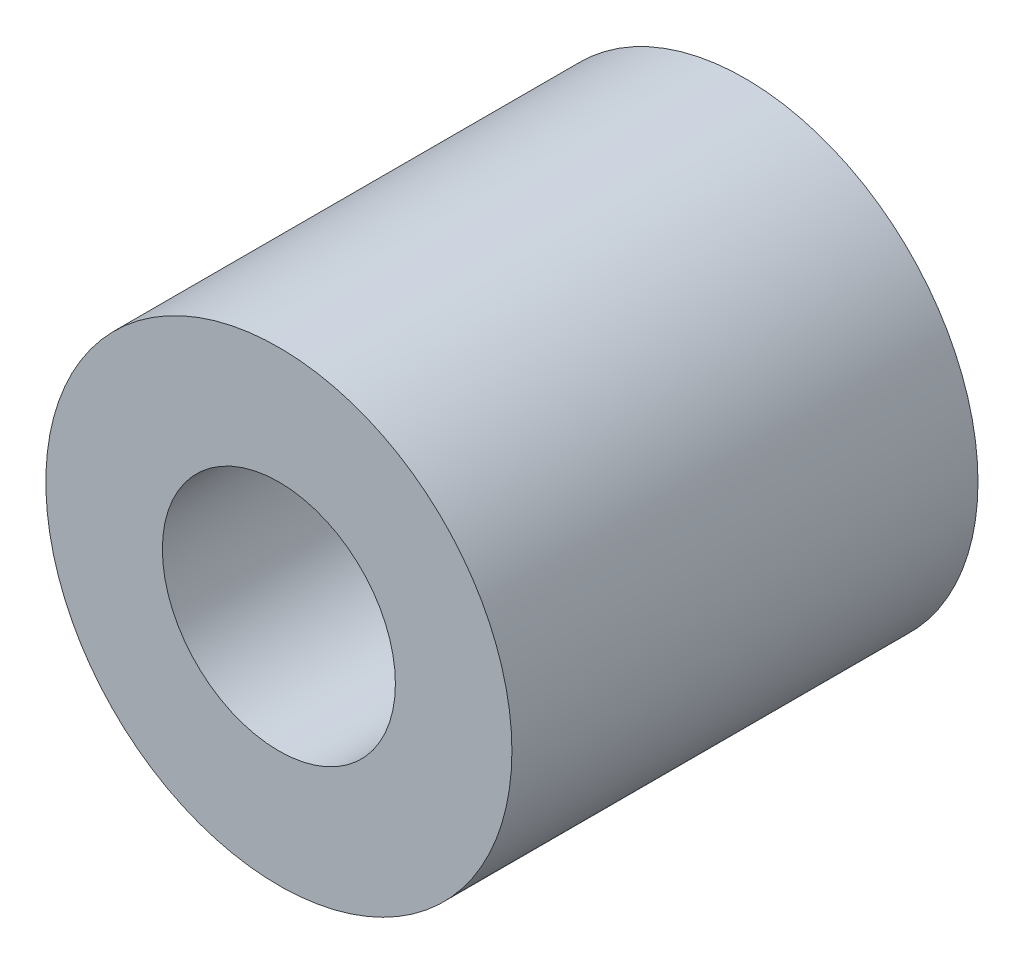
ISO-10303-21;
HEADER;
FILE_DESCRIPTION(('STEP AP214'),'2;1');
FILE_NAME('part.step','',(''),(''),'','','');
FILE_SCHEMA(('AUTOMOTIVE_DESIGN { 1 0 10303 214 1 1 1 1 }'));
ENDSEC;
DATA;
#1=APPLICATION_CONTEXT('core data for automotive mechanical design processes');
#2=APPLICATION_PROTOCOL_DEFINITION('international standard','automotive_design',2000,#1);
#3=PRODUCT_CONTEXT('',#1,'mechanical');
#4=PRODUCT('Part','Part','',(#3));
#5=PRODUCT_RELATED_PRODUCT_CATEGORY('part','',(#4));
#6=PRODUCT_DEFINITION_FORMATION('','',#4);
#7=PRODUCT_DEFINITION_CONTEXT('part definition',#1,'design');
#8=PRODUCT_DEFINITION('design','',#6,#7);
#9=PRODUCT_DEFINITION_SHAPE('','',#8);
#10=(LENGTH_UNIT() NAMED_UNIT(*) SI_UNIT(.MILLI.,.METRE.));
#11=(NAMED_UNIT(*) PLANE_ANGLE_UNIT() SI_UNIT($,.RADIAN.));
#12=(NAMED_UNIT(*) SI_UNIT($,.STERADIAN.) SOLID_ANGLE_UNIT());
#13=UNCERTAINTY_MEASURE_WITH_UNIT(LENGTH_MEASURE(1.E-05),#10,'distance_accuracy_value','');
#14=(GEOMETRIC_REPRESENTATION_CONTEXT(3) GLOBAL_UNCERTAINTY_ASSIGNED_CONTEXT((#13)) GLOBAL_UNIT_ASSIGNED_CONTEXT((#10,
#11,#12)) REPRESENTATION_CONTEXT('',''));
#15=CARTESIAN_POINT('',(0.,0.,0.));
#16=DIRECTION('',(0.,0.,1.));
#17=DIRECTION('',(1.,0.,0.));
#18=AXIS2_PLACEMENT_3D('',#15,#16,#17);
#19=CARTESIAN_POINT('',(0.,0.,40.));
#20=DIRECTION('',(0.,0.,0.999999999999992));
#21=DIRECTION('',(1.,0.,0.));
#22=AXIS2_PLACEMENT_3D('',#19,#20,#21);
#23=PLANE('',#22);
#24=CARTESIAN_POINT('',(0.,0.,40.));
#25=DIRECTION('',(0.,0.,0.999999999999992));
#26=DIRECTION('',(1.,0.,0.));
#27=AXIS2_PLACEMENT_3D('',#24,#25,#26);
#28=CIRCLE('',#27,20.);
#29=CARTESIAN_POINT('',(20.,0.,40.));
#30=VERTEX_POINT('',#29);
#31=EDGE_CURVE('E10',#30,#30,#28,.T.);
#32=ORIENTED_EDGE('',*,*,#31,.T.);
#33=EDGE_LOOP('',(#32));
#34=FACE_BOUND('',#33,.T.);
#35=CARTESIAN_POINT('',(0.,0.,40.));
#36=DIRECTION('',(0.,0.,0.999999999999992));
#37=DIRECTION('',(1.,0.,0.));
#38=AXIS2_PLACEMENT_3D('',#35,#36,#37);
#39=CIRCLE('',#38,10.);
#40=CARTESIAN_POINT('',(10.,0.,40.));
#41=VERTEX_POINT('',#40);
#42=EDGE_CURVE('E46',#41,#41,#39,.T.);
#43=ORIENTED_EDGE('',*,*,#42,.F.);
#44=EDGE_LOOP('',(#43));
#45=FACE_BOUND('',#44,.T.);
#46=ADVANCED_FACE('F34',(#34,#45),#23,.T.);
#47=CARTESIAN_POINT('',(0.,0.,0.));
#48=DIRECTION('',(0.,0.,0.999999999999992));
#49=DIRECTION('',(1.,0.,0.));
#50=AXIS2_PLACEMENT_3D('',#47,#48,#49);
#51=PLANE('',#50);
#52=CARTESIAN_POINT('',(0.,0.,0.));
#53=DIRECTION('',(0.,0.,0.999999999999992));
#54=DIRECTION('',(1.,0.,0.));
#55=AXIS2_PLACEMENT_3D('',#52,#53,#54);
#56=CIRCLE('',#55,20.);
#57=CARTESIAN_POINT('',(20.,0.,0.));
#58=VERTEX_POINT('',#57);
#59=EDGE_CURVE('E39',#58,#58,#56,.T.);
#60=ORIENTED_EDGE('',*,*,#59,.F.);
#61=EDGE_LOOP('',(#60));
#62=FACE_BOUND('',#61,.T.);
#63=CARTESIAN_POINT('',(0.,0.,0.));
#64=DIRECTION('',(0.,0.,0.999999999999992));
#65=DIRECTION('',(1.,0.,0.));
#66=AXIS2_PLACEMENT_3D('',#63,#64,#65);
#67=CIRCLE('',#66,10.);
#68=CARTESIAN_POINT('',(10.,0.,0.));
#69=VERTEX_POINT('',#68);
#70=EDGE_CURVE('E48',#69,#69,#67,.T.);
#71=ORIENTED_EDGE('',*,*,#70,.T.);
#72=EDGE_LOOP('',(#71));
#73=FACE_BOUND('',#72,.T.);
#74=ADVANCED_FACE('F75',(#62,#73),#51,.F.);
#75=CARTESIAN_POINT('',(0.,0.,40.));
#76=DIRECTION('',(0.,0.,-0.999999999999992));
#77=DIRECTION('',(-1.,0.,0.));
#78=AXIS2_PLACEMENT_3D('',#75,#76,#77);
#79=CYLINDRICAL_SURFACE('',#78,20.);
#80=CARTESIAN_POINT('',(-20.0000000000001,-6.66133814775094E-12,25.0999999999999));
#81=CARTESIAN_POINT('',(-19.9999953700607,-0.281593693260351,25.0999924382015));
#82=CARTESIAN_POINT('',(-19.9939938349627,-0.56327080093145,25.0765995565436));
#83=CARTESIAN_POINT('',(-19.9706344354914,-1.11853993870598,24.9837937120363));
#84=CARTESIAN_POINT('',(-19.9532704208326,-1.39212750622902,24.914355825664));
#85=CARTESIAN_POINT('',(-19.9091070187447,-1.92311982468024,24.7318421430751));
#86=CARTESIAN_POINT('',(-19.8823192123796,-2.18054398356515,24.6188198921321));
#87=CARTESIAN_POINT('',(-19.8221546798945,-2.67277992373004,24.3525371431092));
#88=CARTESIAN_POINT('',(-19.7887776668652,-2.90759071970938,24.1992748927909));
#89=CARTESIAN_POINT('',(-19.718255227579,-3.35295020324059,23.8534051517962));
#90=CARTESIAN_POINT('',(-19.6810497925632,-3.56294704178449,23.6600992782923));
#91=CARTESIAN_POINT('',(-19.6074585015317,-3.94791949036337,23.2411240871343));
#92=CARTESIAN_POINT('',(-19.5710727421882,-4.12289098852202,23.0154509749894));
#93=CARTESIAN_POINT('',(-19.5026329758627,-4.43546926378927,22.5338272342121));
#94=CARTESIAN_POINT('',(-19.4706550151773,-4.57245357771442,22.2774608296197));
#95=CARTESIAN_POINT('',(-19.4155287791544,-4.80116418798557,21.7443907333934));
#96=CARTESIAN_POINT('',(-19.3923790293973,-4.89289804246475,21.4676904469819));
#97=CARTESIAN_POINT('',(-19.3581479008536,-5.02661115652345,20.9078882049761));
#98=CARTESIAN_POINT('',(-19.3468256375582,-5.0695851188635,20.6250389188095));
#99=CARTESIAN_POINT('',(-19.3368107921039,-5.10765775761665,20.0559364427054));
#100=CARTESIAN_POINT('',(-19.338116066574,-5.10276455889664,19.7696838386779));
#101=CARTESIAN_POINT('',(-19.3529925537172,-5.0460342461013,19.2095647993599));
#102=CARTESIAN_POINT('',(-19.3662526504213,-4.99538776240316,18.9355682133077));
#103=CARTESIAN_POINT('',(-19.403048207716,-4.85049010416291,18.4000952765788));
#104=CARTESIAN_POINT('',(-19.4265844266133,-4.75623571162825,18.1386198514575));
#105=CARTESIAN_POINT('',(-19.481562308758,-4.52579626258676,17.632445169881));
#106=CARTESIAN_POINT('',(-19.5130839933317,-4.38918343316548,17.3879497171));
#107=CARTESIAN_POINT('',(-19.5804365715838,-4.07820399394842,16.9249288519765));
#108=CARTESIAN_POINT('',(-19.6162682467096,-3.90383053314518,16.7064081634599));
#109=CARTESIAN_POINT('',(-19.6895090612946,-3.51613567060429,16.2947227033973));
#110=CARTESIAN_POINT('',(-19.7269334373531,-3.30181094813394,16.1025042670785));
#111=CARTESIAN_POINT('',(-19.7981843663542,-2.84351757126044,15.756553687376));
#112=CARTESIAN_POINT('',(-19.832010800458,-2.59954793826687,15.602822814995));
#113=CARTESIAN_POINT('',(-19.8924341251373,-2.08750610590584,15.3378435809263));
#114=CARTESIAN_POINT('',(-19.9190038775779,-1.819348288388,15.2267540760381));
#115=CARTESIAN_POINT('',(-19.9617231925806,-1.26733414005924,15.0514975420235));
#116=CARTESIAN_POINT('',(-19.9778748312873,-0.983480949305799,14.9873211636065));
#117=CARTESIAN_POINT('',(-19.9976288485594,-0.416220244871438,14.9091697726909));
#118=CARTESIAN_POINT('',(-20.001553145067,-0.133001137968097,14.8939066700732));
#119=CARTESIAN_POINT('',(-19.9973297381929,0.431946107556255,14.9104750599093));
#120=CARTESIAN_POINT('',(-19.9891831684354,0.713674383693658,14.942302129933));
#121=CARTESIAN_POINT('',(-19.9619401760481,1.26313104865037,15.0510871233522));
#122=CARTESIAN_POINT('',(-19.9430154727701,1.53100876903227,15.1273377097891));
#123=CARTESIAN_POINT('',(-19.8963529551052,2.05015351333743,15.3219933758402));
#124=CARTESIAN_POINT('',(-19.8686142304291,2.30141881833412,15.4404028096629));
#125=CARTESIAN_POINT('',(-19.806634404157,2.78529599263063,15.7184797140718));
#126=CARTESIAN_POINT('',(-19.7722835975264,3.01748235295474,15.8788625590451));
#127=CARTESIAN_POINT('',(-19.7010552713667,3.45210175920446,16.235423685987));
#128=CARTESIAN_POINT('',(-19.6641772979753,3.65452944003003,16.4316084083103));
#129=CARTESIAN_POINT('',(-19.5908845906283,4.02922896076406,16.8601945384421));
#130=CARTESIAN_POINT('',(-19.5545059157003,4.2005956010997,17.0933948750543));
#131=CARTESIAN_POINT('',(-19.4873800766667,4.50176834189063,17.5859978471144));
#132=CARTESIAN_POINT('',(-19.4566326655099,4.63157626577008,17.8453993323076));
#133=CARTESIAN_POINT('',(-19.4045946759758,4.84497421301658,18.3816715311362));
#134=CARTESIAN_POINT('',(-19.383248372522,4.92883731783643,18.6584278848496));
#135=CARTESIAN_POINT('',(-19.3523868691654,5.04866549545467,19.2227428088353));
#136=CARTESIAN_POINT('',(-19.3428689561729,5.08464155228736,19.5102988863691));
#137=CARTESIAN_POINT('',(-19.3369545774843,5.10708316681138,20.0788231899589));
#138=CARTESIAN_POINT('',(-19.3401740565275,5.09499780493225,20.3597311176724));
#139=CARTESIAN_POINT('',(-19.3584804571502,5.02498929150929,20.9153614937328));
#140=CARTESIAN_POINT('',(-19.3735671212969,4.96706713429579,21.1900840761243));
#141=CARTESIAN_POINT('',(-19.4136895985366,4.80783528914202,21.7238969712651));
#142=CARTESIAN_POINT('',(-19.4386606344553,4.70680776267595,21.9830766562173));
#143=CARTESIAN_POINT('',(-19.4957450354052,4.46445470157786,22.4809960156262));
#144=CARTESIAN_POINT('',(-19.5278594300991,4.32312335661779,22.7197327365023));
#145=CARTESIAN_POINT('',(-19.596698384326,3.99967612649389,23.1769667300074));
#146=CARTESIAN_POINT('',(-19.6335242217871,3.81655961111043,23.3947410197558));
#147=CARTESIAN_POINT('',(-19.7070438836695,3.41667625559524,23.7969416000048));
#148=CARTESIAN_POINT('',(-19.7437376744413,3.19990138468128,23.9813599090758));
#149=CARTESIAN_POINT('',(-19.8136936787226,2.73386991811834,24.3150481804107));
#150=CARTESIAN_POINT('',(-19.8468771895234,2.48407313906262,24.4635815107468));
#151=CARTESIAN_POINT('',(-19.9052348968219,1.96222701231336,24.7163103789281));
#152=CARTESIAN_POINT('',(-19.9304146553416,1.69019328366964,24.8205367239525));
#153=CARTESIAN_POINT('',(-19.9663412128989,1.18232816372174,24.9667690475203));
#154=CARTESIAN_POINT('',(-19.9788750265002,0.94885113238619,25.0166203405176));
#155=CARTESIAN_POINT('',(-19.995706044388,0.476935741563525,25.0832376679752));
#156=CARTESIAN_POINT('',(-20.0000039213604,0.238497788877204,25.1000064045191));
#157=CARTESIAN_POINT('',(-20.0000000000001,-6.66133814775094E-12,25.0999999999999));
#158=B_SPLINE_CURVE_WITH_KNOTS('',3,(#80,#81,#82,#83,#84,#85,#86,#87,#88,#89,#90,#91,#92,#93,
#94,#95,#96,#97,#98,#99,#100,#101,#102,#103,#104,#105,#106,#107,#108,#109,#110,#111,#112,#113,
#114,#115,#116,#117,#118,#119,#120,#121,#122,#123,#124,#125,#126,#127,#128,#129,#130,#131,#132,
#133,#134,#135,#136,#137,#138,#139,#140,#141,#142,#143,#144,#145,#146,#147,#148,#149,#150,#151,
#152,#153,#154,#155,#156,#157),.UNSPECIFIED.,.T.,.F.,(4,2,2,2,2,2,2,2,2,2,2,2,2,2,2,2,2,2,2,2,2,
2,2,2,2,2,2,2,2,2,2,2,2,2,2,2,2,2,4),(0.,0.843906890784378,1.68827094995648,2.53160095932842,
3.37496769733797,4.23451328565976,5.09415972311036,5.96715625446045,6.84000692076861,
7.6947118897174,8.54927178543749,9.38221462543796,10.2152189412477,11.0569258652319,
11.898785630385,12.7656598200743,13.6325626334066,14.5026643801343,15.3725926774661,
16.2194154186829,17.0661586363699,17.8997743546775,18.7334761946484,19.582434923912,
20.4315465221021,21.3024068398288,22.1732289425774,23.0388173938428,23.9042072675604,
24.7437059135238,25.5831863488755,26.4172539957697,27.2514419453759,28.1082153456627,
28.9651934845266,29.8384996995971,30.7111976972182,31.4260090493294,32.1407620153861),.UNSPECIFIED.);
#159=CARTESIAN_POINT('',(-20.0000000000001,-6.66133814775094E-12,25.0999999999999));
#160=VERTEX_POINT('',#159);
#161=EDGE_CURVE('E51',#160,#160,#158,.T.);
#162=ORIENTED_EDGE('',*,*,#161,.T.);
#163=EDGE_LOOP('',(#162));
#164=FACE_BOUND('',#163,.T.);
#165=ORIENTED_EDGE('',*,*,#31,.F.);
#166=EDGE_LOOP('',(#165));
#167=FACE_BOUND('',#166,.T.);
#168=ORIENTED_EDGE('',*,*,#59,.T.);
#169=EDGE_LOOP('',(#168));
#170=FACE_BOUND('',#169,.T.);
#171=ADVANCED_FACE('F36',(#164,#167,#170),#79,.T.);
#172=CARTESIAN_POINT('',(0.,0.,40.));
#173=DIRECTION('',(0.,0.,-0.999999999999992));
#174=DIRECTION('',(-1.,0.,0.));
#175=AXIS2_PLACEMENT_3D('',#172,#173,#174);
#176=CYLINDRICAL_SURFACE('',#175,10.);
#177=CARTESIAN_POINT('',(-10.0000000000001,-4.44089209850063E-12,25.0999999999999));
#178=CARTESIAN_POINT('',(-9.99999980465958,-0.13379383142729,25.0999998041554));
#179=CARTESIAN_POINT('',(-9.99730878290401,-0.267592153865658,25.094729197216));
#180=CARTESIAN_POINT('',(-9.98661302298941,-0.534199128906797,25.0737087724711));
#181=CARTESIAN_POINT('',(-9.97860611447853,-0.667007354871637,25.0579546744962));
#182=CARTESIAN_POINT('',(-9.95747059616641,-0.930755288630551,25.0161286374148));
#183=CARTESIAN_POINT('',(-9.94433514467576,-1.0616922571983,24.9900429148187));
#184=CARTESIAN_POINT('',(-9.91327133100651,-1.32063120191307,24.9278467267357));
#185=CARTESIAN_POINT('',(-9.89534100976846,-1.4486319551366,24.8917321634923));
#186=CARTESIAN_POINT('',(-9.85521616129842,-1.7002554350846,24.8100464662341));
#187=CARTESIAN_POINT('',(-9.83304071966489,-1.82389492935038,24.764517587173));
#188=CARTESIAN_POINT('',(-9.78489593887096,-2.06667845828941,24.6643444189896));
#189=CARTESIAN_POINT('',(-9.75892517091199,-2.18582077859594,24.6096966958595));
#190=CARTESIAN_POINT('',(-9.67620451525559,-2.53539554663614,24.4328166405175));
#191=CARTESIAN_POINT('',(-9.61460123435931,-2.75824625976273,24.2975586620776));
#192=CARTESIAN_POINT('',(-9.47965013679618,-3.19236440900018,23.9867942622889));
#193=CARTESIAN_POINT('',(-9.40581014180936,-3.40204917773274,23.8093076710479));
#194=CARTESIAN_POINT('',(-9.25624228960369,-3.79015487347334,23.4234097322236));
#195=CARTESIAN_POINT('',(-9.18051298520599,-3.96855093815752,23.2149740328218));
#196=CARTESIAN_POINT('',(-9.02857070618664,-4.30366061400429,22.7525202179601));
#197=CARTESIAN_POINT('',(-8.95282143450877,-4.45742168703664,22.4961715108705));
#198=CARTESIAN_POINT('',(-8.85155843679859,-4.65352994283823,22.0921630117685));
#199=CARTESIAN_POINT('',(-8.81985574514012,-4.71315792528647,21.9541966631838));
#200=CARTESIAN_POINT('',(-8.76176891376061,-4.82028187161545,21.6725823054649));
#201=CARTESIAN_POINT('',(-8.73538157054595,-4.86778514754362,21.5289377813255));
#202=CARTESIAN_POINT('',(-8.69044036095618,-4.94754661433268,21.2458315351344));
#203=CARTESIAN_POINT('',(-8.67151024505367,-4.98055102543604,21.10663943606));
#204=CARTESIAN_POINT('',(-8.64011875780377,-5.03481223703059,20.8253281454768));
#205=CARTESIAN_POINT('',(-8.62765388656255,-5.05607539393286,20.6832105810531));
#206=CARTESIAN_POINT('',(-8.60973543933089,-5.08652827695006,20.3973405670127));
#207=CARTESIAN_POINT('',(-8.60427722552788,-5.09572598945356,20.2535892624408));
#208=CARTESIAN_POINT('',(-8.60060883992552,-5.10191567374248,19.9657381423302));
#209=CARTESIAN_POINT('',(-8.60239792541088,-5.09890889626431,19.8216383640163));
#210=CARTESIAN_POINT('',(-8.61245778606067,-5.08189398506071,19.5525988120147));
#211=CARTESIAN_POINT('',(-8.61988319823831,-5.06932020997451,19.427533265594));
#212=CARTESIAN_POINT('',(-8.63994384198094,-5.03505362260364,19.1790430898176));
#213=CARTESIAN_POINT('',(-8.65258070031437,-5.01335796285421,19.055618985272));
#214=CARTESIAN_POINT('',(-8.68264789827165,-4.9611018939603,18.811272821069));
#215=CARTESIAN_POINT('',(-8.70007773916344,-4.93054240712002,18.690350502496));
#216=CARTESIAN_POINT('',(-8.73918822111785,-4.86088255378686,18.4516786698472));
#217=CARTESIAN_POINT('',(-8.76087053666601,-4.82177882215537,18.3339304264606));
#218=CARTESIAN_POINT('',(-8.83244839111043,-4.69020336648697,17.9811280342114));
#219=CARTESIAN_POINT('',(-8.88816102884687,-4.58464459425742,17.7519835244854));
#220=CARTESIAN_POINT('',(-9.00898628531301,-4.34239959569991,17.313659155548));
#221=CARTESIAN_POINT('',(-9.07410312451774,-4.20569937753391,17.1044883306397));
#222=CARTESIAN_POINT('',(-9.21683395605003,-3.88392960327092,16.6827033231817));
#223=CARTESIAN_POINT('',(-9.29495999655121,-3.69484948341254,16.4733118841173));
#224=CARTESIAN_POINT('',(-9.44797308841397,-3.28386524792664,16.0877674533563));
#225=CARTESIAN_POINT('',(-9.52285845501449,-3.0619443177969,15.9116315942857));
#226=CARTESIAN_POINT('',(-9.62891878117463,-2.70198547032646,15.6720083180913));
#227=CARTESIAN_POINT('',(-9.66397937337538,-2.57408511740592,15.594715283705));
#228=CARTESIAN_POINT('',(-9.73018910363,-2.31122235683539,15.4513039867408));
#229=CARTESIAN_POINT('',(-9.76133989476509,-2.17626296820371,15.3851809973001));
#230=CARTESIAN_POINT('',(-9.8188103016881,-1.9002206042079,15.2648306768244));
#231=CARTESIAN_POINT('',(-9.84513196176438,-1.75914025141576,15.2105983102947));
#232=CARTESIAN_POINT('',(-9.89215649541348,-1.47187264882167,15.1146636756263));
#233=CARTESIAN_POINT('',(-9.91286004485873,-1.32568601570817,15.0729599002029));
#234=CARTESIAN_POINT('',(-9.94649450558929,-1.04205474096032,15.0056505621415));
#235=CARTESIAN_POINT('',(-9.95993651413735,-0.904923251822692,14.9789779481382));
#236=CARTESIAN_POINT('',(-9.98119138026854,-0.628510248654106,14.9369464025714));
#237=CARTESIAN_POINT('',(-9.9890047628088,-0.489228936365603,14.921586415926));
#238=CARTESIAN_POINT('',(-9.99877804425734,-0.209726330158537,14.9023897270433));
#239=CARTESIAN_POINT('',(-10.0007403124667,-0.0695054397640792,14.8985483605491));
#240=CARTESIAN_POINT('',(-9.99876106519027,0.210730952355337,14.902429364996));
#241=CARTESIAN_POINT('',(-9.99481983207865,0.350746463583275,14.9101511828508));
#242=CARTESIAN_POINT('',(-9.98170806485841,0.617995799459625,14.935949651752));
#243=CARTESIAN_POINT('',(-9.97299078695864,0.745339789364347,14.9531293342936));
#244=CARTESIAN_POINT('',(-9.95088226111554,0.998014095216063,14.9969593608488));
#245=CARTESIAN_POINT('',(-9.93748953837514,1.1233437627123,15.0236126932275));
#246=CARTESIAN_POINT('',(-9.90634471640393,1.37109847537933,15.0861012680829));
#247=CARTESIAN_POINT('',(-9.88859396214367,1.4935244039397,15.1219336778713));
#248=CARTESIAN_POINT('',(-9.84913465176214,1.73479856473604,15.2024303829126));
#249=CARTESIAN_POINT('',(-9.82742457879159,1.8536454053906,15.2470980635911));
#250=CARTESIAN_POINT('',(-9.75575598226175,2.21016905481016,15.3964556898428));
#251=CARTESIAN_POINT('',(-9.70012931202382,2.44115664909472,15.5148111233832));
#252=CARTESIAN_POINT('',(-9.57884325469315,2.88061156611017,15.78353482734));
#253=CARTESIAN_POINT('',(-9.51317968256156,3.08906943254633,15.9339164619023));
#254=CARTESIAN_POINT('',(-9.37024254153391,3.5000727284223,16.2799500650784));
#255=CARTESIAN_POINT('',(-9.29246646129517,3.69988689454648,16.4786426548614));
#256=CARTESIAN_POINT('',(-9.13879483311272,4.06468696319419,16.9068737860106));
#257=CARTESIAN_POINT('',(-9.062900754972,4.22964635685061,17.136435589436));
#258=CARTESIAN_POINT('',(-8.95489435267768,4.45164675455495,17.5069846811356));
#259=CARTESIAN_POINT('',(-8.91903722706667,4.52285398654685,17.6385803611723));
#260=CARTESIAN_POINT('',(-8.85143551900445,4.65376294936523,17.9083643242538));
#261=CARTESIAN_POINT('',(-8.8196890749833,4.71346989424501,18.0465495840628));
#262=CARTESIAN_POINT('',(-8.76155207619725,4.82067713491329,18.3285310464134));
#263=CARTESIAN_POINT('',(-8.7351569622228,4.86818783088971,18.4723223471279));
#264=CARTESIAN_POINT('',(-8.68882010557829,4.95041813658489,18.7645314642822));
#265=CARTESIAN_POINT('',(-8.6688773158707,4.98513982174055,18.9129485257965));
#266=CARTESIAN_POINT('',(-8.63795316154006,5.03851366127306,19.1985098952578));
#267=CARTESIAN_POINT('',(-8.62629004966712,5.05839810339252,19.3353507542838));
#268=CARTESIAN_POINT('',(-8.60945908716572,5.08699256017995,19.6105864939709));
#269=CARTESIAN_POINT('',(-8.60429049491681,5.09570385073184,19.7489811953747));
#270=CARTESIAN_POINT('',(-8.60066838390428,5.10181496406348,20.0260520871636));
#271=CARTESIAN_POINT('',(-8.60221217982405,5.09921931022889,20.1647281428032));
#272=CARTESIAN_POINT('',(-8.61194219362146,5.082769160494,20.4411685330466));
#273=CARTESIAN_POINT('',(-8.62012809626524,5.06891519891206,20.5789329106057));
#274=CARTESIAN_POINT('',(-8.64162830069182,5.03216259753575,20.8382579459964));
#275=CARTESIAN_POINT('',(-8.65432672062321,5.01034395490892,20.9600245912454));
#276=CARTESIAN_POINT('',(-8.6843740126179,4.95807903378469,21.2011193488058));
#277=CARTESIAN_POINT('',(-8.7017243129803,4.92763010530648,21.3204467000329));
#278=CARTESIAN_POINT('',(-8.75999153566291,4.82378603889983,21.6736866947358));
#279=CARTESIAN_POINT('',(-8.80713912532193,4.73787049405223,21.9030172617087));
#280=CARTESIAN_POINT('',(-8.91653771231668,4.52880779199954,22.359488193788));
#281=CARTESIAN_POINT('',(-8.97958723689853,4.40355692870894,22.5854589124279));
#282=CARTESIAN_POINT('',(-9.11245109238675,4.1215911095075,23.0147063474808));
#283=CARTESIAN_POINT('',(-9.18226899815033,3.96485947903499,23.2179709478745));
#284=CARTESIAN_POINT('',(-9.33150578513615,3.60089905257343,23.623109677783));
#285=CARTESIAN_POINT('',(-9.4110075829338,3.38977187812295,23.8214619176592));
#286=CARTESIAN_POINT('',(-9.56258676376055,2.93499826462238,24.1808678975463));
#287=CARTESIAN_POINT('',(-9.63465992616618,2.69133351765106,24.3419004983381));
#288=CARTESIAN_POINT('',(-9.73182516934789,2.30427708488634,24.5521751164904));
#289=CARTESIAN_POINT('',(-9.76254960222286,2.17074302285548,24.6173676394271));
#290=CARTESIAN_POINT('',(-9.81927955478133,1.89766783571486,24.7361361490014));
#291=CARTESIAN_POINT('',(-9.84528739543896,1.75812970718399,24.7897178517172));
#292=CARTESIAN_POINT('',(-9.89175835487969,1.47436547429902,24.884525011058));
#293=CARTESIAN_POINT('',(-9.91223330006263,1.33015011890134,24.9257768427759));
#294=CARTESIAN_POINT('',(-9.94706727389729,1.03800966030315,24.9955042882975));
#295=CARTESIAN_POINT('',(-9.96142993863094,0.890086818236724,25.0239874984566));
#296=CARTESIAN_POINT('',(-9.98160599380418,0.618564538132515,25.063861441277));
#297=CARTESIAN_POINT('',(-9.98849000212539,0.495354945832852,25.0774000923703));
#298=CARTESIAN_POINT('',(-9.99768715646178,0.248098204041795,25.0954695821065));
#299=CARTESIAN_POINT('',(-10.0000001811161,0.124051032400168,25.1000001815831));
#300=CARTESIAN_POINT('',(-10.0000000000001,-4.44089209850063E-12,25.0999999999999));
#301=B_SPLINE_CURVE_WITH_KNOTS('',3,(#177,#178,#179,#180,#181,#182,#183,#184,#185,#186,#187,
#188,#189,#190,#191,#192,#193,#194,#195,#196,#197,#198,#199,#200,#201,#202,#203,#204,#205,#206,
#207,#208,#209,#210,#211,#212,#213,#214,#215,#216,#217,#218,#219,#220,#221,#222,#223,#224,#225,
#226,#227,#228,#229,#230,#231,#232,#233,#234,#235,#236,#237,#238,#239,#240,#241,#242,#243,#244,
#245,#246,#247,#248,#249,#250,#251,#252,#253,#254,#255,#256,#257,#258,#259,#260,#261,#262,#263,
#264,#265,#266,#267,#268,#269,#270,#271,#272,#273,#274,#275,#276,#277,#278,#279,#280,#281,#282,
#283,#284,#285,#286,#287,#288,#289,#290,#291,#292,#293,#294,#295,#296,#297,#298,#299,#300),
.UNSPECIFIED.,.T.,.F.,(4,2,2,2,2,2,2,2,2,2,2,2,2,2,2,2,2,2,2,2,2,2,2,2,2,2,2,2,2,2,2,2,2,2,2,2,
2,2,2,2,2,2,2,2,2,2,2,2,2,2,2,2,2,2,2,2,2,2,2,2,2,4),(0.,0.401259355843202,0.802682637296555,
1.20464327396965,1.60676839292344,2.00712634744301,2.40763541190486,3.20779887174189,
4.05773277960869,4.90833902364522,5.82827750032485,6.28855391099794,6.74855208337886,
7.18082842123614,7.61287050585882,8.04462646757952,8.47633818334975,8.85363762316355,
9.23105492737382,9.60843297441374,9.98595992002615,10.7577393665479,11.5298662595432,
12.4043999157175,13.2793828925046,13.7393625751932,14.1991471165649,14.6587365686039,
15.1182707063732,15.5387437764274,15.9591776257329,16.3794412049494,16.7996846829046,
17.1856146601357,17.5716664831944,17.9575993128343,18.3436803084733,19.1364182894061,
19.9294877207481,20.8027830629108,21.6767402196917,22.1378073718764,22.5986649886939,
23.0591283000174,23.5195168530932,23.9352358971621,24.3509074652372,24.7664127576121,
25.1818983312911,25.5545393606739,25.9272949358992,26.672324835567,27.4671230264822,
28.2623433172441,29.1595543673204,30.0572723953886,30.5119683773045,30.9664399984486,
31.4199323750232,31.8731545990309,32.2451845745087,32.6172244273554),.UNSPECIFIED.);
#302=CARTESIAN_POINT('',(-10.0000000000001,-4.44089209850063E-12,25.0999999999999));
#303=VERTEX_POINT('',#302);
#304=EDGE_CURVE('E59',#303,#303,#301,.T.);
#305=ORIENTED_EDGE('',*,*,#304,.F.);
#306=EDGE_LOOP('',(#305));
#307=FACE_BOUND('',#306,.T.);
#308=ORIENTED_EDGE('',*,*,#42,.T.);
#309=EDGE_LOOP('',(#308));
#310=FACE_BOUND('',#309,.T.);
#311=ORIENTED_EDGE('',*,*,#70,.F.);
#312=EDGE_LOOP('',(#311));
#313=FACE_BOUND('',#312,.T.);
#314=ADVANCED_FACE('F66',(#307,#310,#313),#176,.F.);
#315=CARTESIAN_POINT('',(-20.0000000000001,-6.66133814775094E-12,20.));
#316=DIRECTION('',(-1.,0.,0.));
#317=DIRECTION('',(0.,0.,0.999999999999992));
#318=AXIS2_PLACEMENT_3D('',#315,#316,#317);
#319=CYLINDRICAL_SURFACE('',#318,5.1);
#320=ORIENTED_EDGE('',*,*,#304,.T.);
#321=EDGE_LOOP('',(#320));
#322=FACE_BOUND('',#321,.T.);
#323=ORIENTED_EDGE('',*,*,#161,.F.);
#324=EDGE_LOOP('',(#323));
#325=FACE_BOUND('',#324,.T.);
#326=ADVANCED_FACE('F63',(#322,#325),#319,.F.);
#327=CLOSED_SHELL('',(#46,#74,#171,#314,#326));
#328=MANIFOLD_SOLID_BREP('B2',#327);
#329=ADVANCED_BREP_SHAPE_REPRESENTATION('',(#18,#328),#14);
#330=SHAPE_DEFINITION_REPRESENTATION(#9,#329);
ENDSEC;
END-ISO-10303-21;
